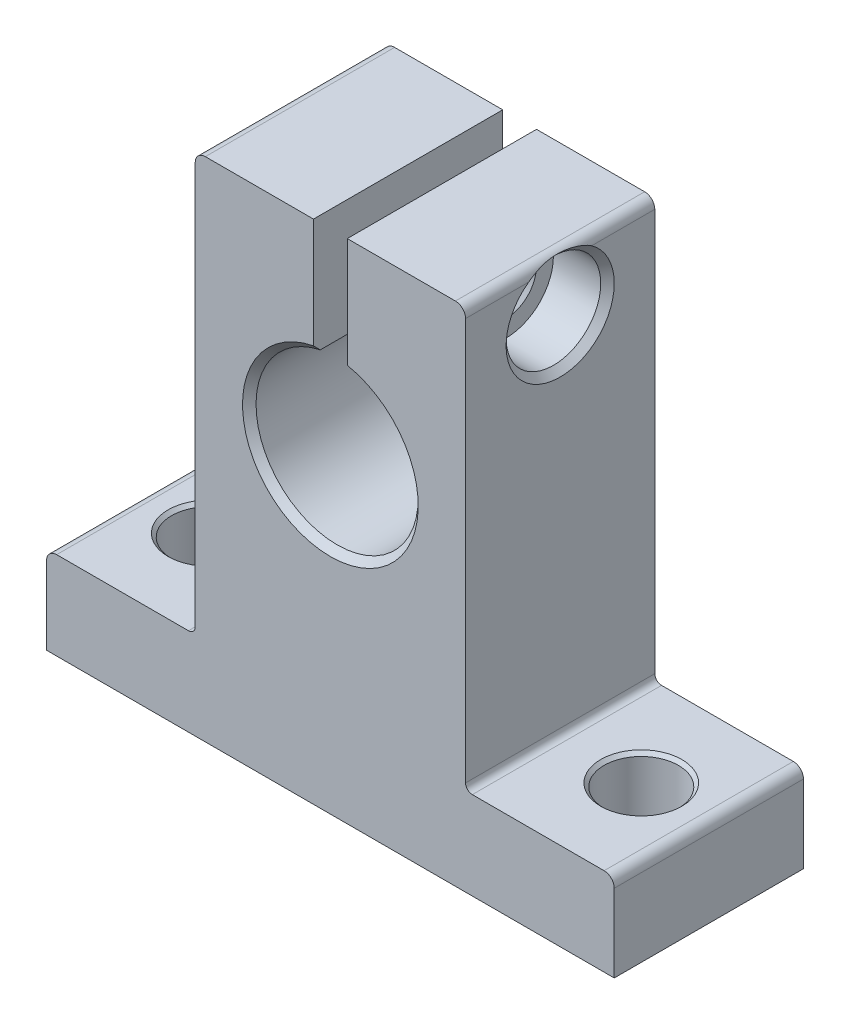
ISO-10303-21;
HEADER;
FILE_DESCRIPTION(('STEP AP214'),'2;1');
FILE_NAME('part.step','',(''),(''),'','','');
FILE_SCHEMA(('AUTOMOTIVE_DESIGN { 1 0 10303 214 1 1 1 1 }'));
ENDSEC;
DATA;
#1=APPLICATION_CONTEXT('core data for automotive mechanical design processes');
#2=APPLICATION_PROTOCOL_DEFINITION('international standard','automotive_design',2000,#1);
#3=PRODUCT_CONTEXT('',#1,'mechanical');
#4=PRODUCT('Part','Part','',(#3));
#5=PRODUCT_RELATED_PRODUCT_CATEGORY('part','',(#4));
#6=PRODUCT_DEFINITION_FORMATION('','',#4);
#7=PRODUCT_DEFINITION_CONTEXT('part definition',#1,'design');
#8=PRODUCT_DEFINITION('design','',#6,#7);
#9=PRODUCT_DEFINITION_SHAPE('','',#8);
#10=(LENGTH_UNIT() NAMED_UNIT(*) SI_UNIT(.MILLI.,.METRE.));
#11=(NAMED_UNIT(*) PLANE_ANGLE_UNIT() SI_UNIT($,.RADIAN.));
#12=(NAMED_UNIT(*) SI_UNIT($,.STERADIAN.) SOLID_ANGLE_UNIT());
#13=UNCERTAINTY_MEASURE_WITH_UNIT(LENGTH_MEASURE(1.E-05),#10,'distance_accuracy_value','');
#14=(GEOMETRIC_REPRESENTATION_CONTEXT(3) GLOBAL_UNCERTAINTY_ASSIGNED_CONTEXT((#13)) GLOBAL_UNIT_ASSIGNED_CONTEXT((#10,
#11,#12)) REPRESENTATION_CONTEXT('',''));
#15=CARTESIAN_POINT('',(0.,0.,0.));
#16=DIRECTION('',(0.,0.,1.));
#17=DIRECTION('',(1.,0.,0.));
#18=AXIS2_PLACEMENT_3D('',#15,#16,#17);
#19=CARTESIAN_POINT('',(-9.99999999999999,14.5,7.));
#20=DIRECTION('',(0.,1.,0.));
#21=DIRECTION('',(0.,0.,1.));
#22=AXIS2_PLACEMENT_3D('',#19,#20,#21);
#23=PLANE('',#22);
#24=DIRECTION('',(1.,0.,0.));
#25=VECTOR('',#24,1.);
#26=CARTESIAN_POINT('',(-9.99999999999999,14.5,-7.));
#27=LINE('',#26,#25);
#28=CARTESIAN_POINT('',(-9.24999999999999,14.5,-7.));
#29=VERTEX_POINT('',#28);
#30=CARTESIAN_POINT('',(-1.25,14.5,-7.));
#31=VERTEX_POINT('',#30);
#32=EDGE_CURVE('E434',#29,#31,#27,.T.);
#33=ORIENTED_EDGE('',*,*,#32,.F.);
#34=DIRECTION('',(0.,0.,-1.));
#35=VECTOR('',#34,1.);
#36=CARTESIAN_POINT('',(-9.24999999999999,14.5,7.));
#37=LINE('',#36,#35);
#38=CARTESIAN_POINT('',(-9.24999999999999,14.5,7.));
#39=VERTEX_POINT('',#38);
#40=EDGE_CURVE('E242',#29,#39,#37,.F.);
#41=ORIENTED_EDGE('',*,*,#40,.T.);
#42=DIRECTION('',(1.,0.,0.));
#43=VECTOR('',#42,1.);
#44=CARTESIAN_POINT('',(-9.99999999999999,14.5,7.));
#45=LINE('',#44,#43);
#46=CARTESIAN_POINT('',(-1.25,14.5,7.));
#47=VERTEX_POINT('',#46);
#48=EDGE_CURVE('E418',#39,#47,#45,.T.);
#49=ORIENTED_EDGE('',*,*,#48,.T.);
#50=DIRECTION('',(0.,0.,-1.));
#51=VECTOR('',#50,1.);
#52=CARTESIAN_POINT('',(-1.25,14.5,7.));
#53=LINE('',#52,#51);
#54=EDGE_CURVE('E423',#47,#31,#53,.T.);
#55=ORIENTED_EDGE('',*,*,#54,.T.);
#56=EDGE_LOOP('',(#33,#41,#49,#55));
#57=FACE_BOUND('',#56,.T.);
#58=ADVANCED_FACE('F38',(#57),#23,.T.);
#59=CARTESIAN_POINT('',(-9.99999999999999,14.5,7.));
#60=DIRECTION('',(1.,0.,0.));
#61=DIRECTION('',(0.,1.,0.));
#62=AXIS2_PLACEMENT_3D('',#59,#60,#61);
#63=PLANE('',#62);
#64=CARTESIAN_POINT('',(-9.99999999999999,10.5,0.));
#65=DIRECTION('',(-1.,0.,0.));
#66=DIRECTION('',(0.,0.,1.));
#67=AXIS2_PLACEMENT_3D('',#64,#65,#66);
#68=CIRCLE('',#67,1.45);
#69=CARTESIAN_POINT('',(-9.99999999999999,10.5,1.45));
#70=VERTEX_POINT('',#69);
#71=EDGE_CURVE('E536',#70,#70,#68,.T.);
#72=ORIENTED_EDGE('',*,*,#71,.F.);
#73=EDGE_LOOP('',(#72));
#74=FACE_BOUND('',#73,.T.);
#75=DIRECTION('',(0.,-1.,0.));
#76=VECTOR('',#75,1.);
#77=CARTESIAN_POINT('',(-9.99999999999999,14.5,-7.));
#78=LINE('',#77,#76);
#79=CARTESIAN_POINT('',(-9.99999999999999,13.75,-7.));
#80=VERTEX_POINT('',#79);
#81=CARTESIAN_POINT('',(-10.,-16.,-7.));
#82=VERTEX_POINT('',#81);
#83=EDGE_CURVE('E463',#80,#82,#78,.T.);
#84=ORIENTED_EDGE('',*,*,#83,.T.);
#85=DIRECTION('',(0.,0.,-1.));
#86=VECTOR('',#85,1.);
#87=CARTESIAN_POINT('',(-10.,-16.,7.));
#88=LINE('',#87,#86);
#89=CARTESIAN_POINT('',(-10.,-16.,7.));
#90=VERTEX_POINT('',#89);
#91=EDGE_CURVE('E208',#82,#90,#88,.F.);
#92=ORIENTED_EDGE('',*,*,#91,.T.);
#93=DIRECTION('',(0.,-1.,0.));
#94=VECTOR('',#93,1.);
#95=CARTESIAN_POINT('',(-9.99999999999999,14.5,7.));
#96=LINE('',#95,#94);
#97=CARTESIAN_POINT('',(-9.99999999999999,13.75,7.));
#98=VERTEX_POINT('',#97);
#99=EDGE_CURVE('E416',#98,#90,#96,.T.);
#100=ORIENTED_EDGE('',*,*,#99,.F.);
#101=DIRECTION('',(0.,0.,-1.));
#102=VECTOR('',#101,1.);
#103=CARTESIAN_POINT('',(-9.99999999999999,13.75,-7.));
#104=LINE('',#103,#102);
#105=EDGE_CURVE('E211',#98,#80,#104,.T.);
#106=ORIENTED_EDGE('',*,*,#105,.T.);
#107=EDGE_LOOP('',(#84,#92,#100,#106));
#108=FACE_BOUND('',#107,.T.);
#109=ADVANCED_FACE('F319',(#74,#108),#63,.F.);
#110=CARTESIAN_POINT('',(-21.,-16.5,7.));
#111=DIRECTION('',(0.,1.,0.));
#112=DIRECTION('',(0.,0.,1.));
#113=AXIS2_PLACEMENT_3D('',#110,#111,#112);
#114=PLANE('',#113);
#115=CARTESIAN_POINT('',(-16.,-16.5,0.));
#116=DIRECTION('',(0.,1.,0.));
#117=DIRECTION('',(0.,0.,1.));
#118=AXIS2_PLACEMENT_3D('',#115,#116,#117);
#119=CIRCLE('',#118,3.);
#120=CARTESIAN_POINT('',(-16.,-16.5,3.));
#121=VERTEX_POINT('',#120);
#122=EDGE_CURVE('E527',#121,#121,#119,.T.);
#123=ORIENTED_EDGE('',*,*,#122,.F.);
#124=EDGE_LOOP('',(#123));
#125=FACE_BOUND('',#124,.T.);
#126=DIRECTION('',(1.,0.,0.));
#127=VECTOR('',#126,1.);
#128=CARTESIAN_POINT('',(-21.,-16.5,7.));
#129=LINE('',#128,#127);
#130=CARTESIAN_POINT('',(-20.25,-16.5,7.));
#131=VERTEX_POINT('',#130);
#132=CARTESIAN_POINT('',(-10.5,-16.5,7.));
#133=VERTEX_POINT('',#132);
#134=EDGE_CURVE('E424',#131,#133,#129,.T.);
#135=ORIENTED_EDGE('',*,*,#134,.T.);
#136=DIRECTION('',(0.,0.,-1.));
#137=VECTOR('',#136,1.);
#138=CARTESIAN_POINT('',(-10.5,-16.5,7.));
#139=LINE('',#138,#137);
#140=CARTESIAN_POINT('',(-10.5,-16.5,-7.));
#141=VERTEX_POINT('',#140);
#142=EDGE_CURVE('E477',#133,#141,#139,.T.);
#143=ORIENTED_EDGE('',*,*,#142,.T.);
#144=DIRECTION('',(1.,0.,0.));
#145=VECTOR('',#144,1.);
#146=CARTESIAN_POINT('',(-21.,-16.5,-7.));
#147=LINE('',#146,#145);
#148=CARTESIAN_POINT('',(-20.25,-16.5,-7.));
#149=VERTEX_POINT('',#148);
#150=EDGE_CURVE('E460',#149,#141,#147,.T.);
#151=ORIENTED_EDGE('',*,*,#150,.F.);
#152=DIRECTION('',(0.,0.,-1.));
#153=VECTOR('',#152,1.);
#154=CARTESIAN_POINT('',(-20.25,-16.5,7.));
#155=LINE('',#154,#153);
#156=EDGE_CURVE('E467',#149,#131,#155,.F.);
#157=ORIENTED_EDGE('',*,*,#156,.T.);
#158=EDGE_LOOP('',(#135,#143,#151,#157));
#159=FACE_BOUND('',#158,.T.);
#160=ADVANCED_FACE('F322',(#125,#159),#114,.T.);
#161=CARTESIAN_POINT('',(-21.,-23.,7.));
#162=DIRECTION('',(-1.,0.,0.));
#163=DIRECTION('',(0.,-1.,0.));
#164=AXIS2_PLACEMENT_3D('',#161,#162,#163);
#165=PLANE('',#164);
#166=DIRECTION('',(0.,1.,0.));
#167=VECTOR('',#166,1.);
#168=CARTESIAN_POINT('',(-21.,-23.,7.));
#169=LINE('',#168,#167);
#170=CARTESIAN_POINT('',(-21.,-23.,7.));
#171=VERTEX_POINT('',#170);
#172=CARTESIAN_POINT('',(-21.,-17.25,7.));
#173=VERTEX_POINT('',#172);
#174=EDGE_CURVE('E430',#171,#173,#169,.T.);
#175=ORIENTED_EDGE('',*,*,#174,.T.);
#176=DIRECTION('',(0.,0.,-1.));
#177=VECTOR('',#176,1.);
#178=CARTESIAN_POINT('',(-21.,-17.25,7.));
#179=LINE('',#178,#177);
#180=CARTESIAN_POINT('',(-21.,-17.25,-7.));
#181=VERTEX_POINT('',#180);
#182=EDGE_CURVE('E222',#173,#181,#179,.T.);
#183=ORIENTED_EDGE('',*,*,#182,.T.);
#184=DIRECTION('',(0.,1.,0.));
#185=VECTOR('',#184,1.);
#186=CARTESIAN_POINT('',(-21.,-23.,-7.));
#187=LINE('',#186,#185);
#188=CARTESIAN_POINT('',(-21.,-23.,-7.));
#189=VERTEX_POINT('',#188);
#190=EDGE_CURVE('E457',#189,#181,#187,.T.);
#191=ORIENTED_EDGE('',*,*,#190,.F.);
#192=DIRECTION('',(0.,0.,-1.));
#193=VECTOR('',#192,1.);
#194=CARTESIAN_POINT('',(-21.,-23.,7.));
#195=LINE('',#194,#193);
#196=EDGE_CURVE('E465',#171,#189,#195,.T.);
#197=ORIENTED_EDGE('',*,*,#196,.F.);
#198=EDGE_LOOP('',(#175,#183,#191,#197));
#199=FACE_BOUND('',#198,.T.);
#200=ADVANCED_FACE('F326',(#199),#165,.T.);
#201=CARTESIAN_POINT('',(-21.,-23.,7.));
#202=DIRECTION('',(0.,1.,0.));
#203=DIRECTION('',(-1.,0.,0.));
#204=AXIS2_PLACEMENT_3D('',#201,#202,#203);
#205=PLANE('',#204);
#206=CARTESIAN_POINT('',(-16.,-23.,0.));
#207=DIRECTION('',(0.,1.,0.));
#208=DIRECTION('',(0.,0.,1.));
#209=AXIS2_PLACEMENT_3D('',#206,#207,#208);
#210=CIRCLE('',#209,3.);
#211=CARTESIAN_POINT('',(-16.,-23.,3.));
#212=VERTEX_POINT('',#211);
#213=EDGE_CURVE('E530',#212,#212,#210,.T.);
#214=ORIENTED_EDGE('',*,*,#213,.T.);
#215=EDGE_LOOP('',(#214));
#216=FACE_BOUND('',#215,.T.);
#217=CARTESIAN_POINT('',(16.,-23.,0.));
#218=DIRECTION('',(0.,1.,0.));
#219=DIRECTION('',(0.,0.,1.));
#220=AXIS2_PLACEMENT_3D('',#217,#218,#219);
#221=CIRCLE('',#220,3.);
#222=CARTESIAN_POINT('',(16.,-23.,3.));
#223=VERTEX_POINT('',#222);
#224=EDGE_CURVE('E518',#223,#223,#221,.T.);
#225=ORIENTED_EDGE('',*,*,#224,.T.);
#226=EDGE_LOOP('',(#225));
#227=FACE_BOUND('',#226,.T.);
#228=DIRECTION('',(1.,0.,0.));
#229=VECTOR('',#228,1.);
#230=CARTESIAN_POINT('',(-21.,-23.,-7.));
#231=LINE('',#230,#229);
#232=CARTESIAN_POINT('',(21.,-23.,-7.));
#233=VERTEX_POINT('',#232);
#234=EDGE_CURVE('E455',#189,#233,#231,.T.);
#235=ORIENTED_EDGE('',*,*,#234,.T.);
#236=DIRECTION('',(0.,0.,-1.));
#237=VECTOR('',#236,1.);
#238=CARTESIAN_POINT('',(21.,-23.,7.));
#239=LINE('',#238,#237);
#240=CARTESIAN_POINT('',(21.,-23.,7.));
#241=VERTEX_POINT('',#240);
#242=EDGE_CURVE('E468',#241,#233,#239,.T.);
#243=ORIENTED_EDGE('',*,*,#242,.F.);
#244=DIRECTION('',(1.,0.,0.));
#245=VECTOR('',#244,1.);
#246=CARTESIAN_POINT('',(-21.,-23.,7.));
#247=LINE('',#246,#245);
#248=EDGE_CURVE('E491',#171,#241,#247,.T.);
#249=ORIENTED_EDGE('',*,*,#248,.F.);
#250=ORIENTED_EDGE('',*,*,#196,.T.);
#251=EDGE_LOOP('',(#235,#243,#249,#250));
#252=FACE_BOUND('',#251,.T.);
#253=ADVANCED_FACE('F330',(#216,#227,#252),#205,.F.);
#254=CARTESIAN_POINT('',(21.,-23.,7.));
#255=DIRECTION('',(-1.,0.,0.));
#256=DIRECTION('',(0.,-1.,0.));
#257=AXIS2_PLACEMENT_3D('',#254,#255,#256);
#258=PLANE('',#257);
#259=DIRECTION('',(0.,1.,0.));
#260=VECTOR('',#259,1.);
#261=CARTESIAN_POINT('',(21.,-23.,-7.));
#262=LINE('',#261,#260);
#263=CARTESIAN_POINT('',(21.,-17.25,-7.));
#264=VERTEX_POINT('',#263);
#265=EDGE_CURVE('E452',#233,#264,#262,.T.);
#266=ORIENTED_EDGE('',*,*,#265,.T.);
#267=DIRECTION('',(0.,0.,-1.));
#268=VECTOR('',#267,1.);
#269=CARTESIAN_POINT('',(21.,-17.25,7.));
#270=LINE('',#269,#268);
#271=CARTESIAN_POINT('',(21.,-17.25,7.));
#272=VERTEX_POINT('',#271);
#273=EDGE_CURVE('E240',#264,#272,#270,.F.);
#274=ORIENTED_EDGE('',*,*,#273,.T.);
#275=DIRECTION('',(0.,1.,0.));
#276=VECTOR('',#275,1.);
#277=CARTESIAN_POINT('',(21.,-23.,7.));
#278=LINE('',#277,#276);
#279=EDGE_CURVE('E492',#241,#272,#278,.T.);
#280=ORIENTED_EDGE('',*,*,#279,.F.);
#281=ORIENTED_EDGE('',*,*,#242,.T.);
#282=EDGE_LOOP('',(#266,#274,#280,#281));
#283=FACE_BOUND('',#282,.T.);
#284=ADVANCED_FACE('F334',(#283),#258,.F.);
#285=CARTESIAN_POINT('',(10.,-16.5,7.));
#286=DIRECTION('',(0.,1.,0.));
#287=DIRECTION('',(0.,0.,1.));
#288=AXIS2_PLACEMENT_3D('',#285,#286,#287);
#289=PLANE('',#288);
#290=CARTESIAN_POINT('',(16.,-16.5,0.));
#291=DIRECTION('',(0.,1.,0.));
#292=DIRECTION('',(0.,0.,1.));
#293=AXIS2_PLACEMENT_3D('',#290,#291,#292);
#294=CIRCLE('',#293,3.);
#295=CARTESIAN_POINT('',(16.,-16.5,3.));
#296=VERTEX_POINT('',#295);
#297=EDGE_CURVE('E515',#296,#296,#294,.T.);
#298=ORIENTED_EDGE('',*,*,#297,.F.);
#299=EDGE_LOOP('',(#298));
#300=FACE_BOUND('',#299,.T.);
#301=DIRECTION('',(1.,0.,0.));
#302=VECTOR('',#301,1.);
#303=CARTESIAN_POINT('',(10.,-16.5,-7.));
#304=LINE('',#303,#302);
#305=CARTESIAN_POINT('',(10.5,-16.5,-7.));
#306=VERTEX_POINT('',#305);
#307=CARTESIAN_POINT('',(20.25,-16.5,-7.));
#308=VERTEX_POINT('',#307);
#309=EDGE_CURVE('E449',#306,#308,#304,.T.);
#310=ORIENTED_EDGE('',*,*,#309,.F.);
#311=DIRECTION('',(0.,0.,-1.));
#312=VECTOR('',#311,1.);
#313=CARTESIAN_POINT('',(10.5,-16.5,7.));
#314=LINE('',#313,#312);
#315=CARTESIAN_POINT('',(10.5,-16.5,7.));
#316=VERTEX_POINT('',#315);
#317=EDGE_CURVE('E220',#306,#316,#314,.F.);
#318=ORIENTED_EDGE('',*,*,#317,.T.);
#319=DIRECTION('',(1.,0.,0.));
#320=VECTOR('',#319,1.);
#321=CARTESIAN_POINT('',(10.,-16.5,7.));
#322=LINE('',#321,#320);
#323=CARTESIAN_POINT('',(20.25,-16.5,7.));
#324=VERTEX_POINT('',#323);
#325=EDGE_CURVE('E497',#316,#324,#322,.T.);
#326=ORIENTED_EDGE('',*,*,#325,.T.);
#327=DIRECTION('',(0.,0.,-1.));
#328=VECTOR('',#327,1.);
#329=CARTESIAN_POINT('',(20.25,-16.5,-7.));
#330=LINE('',#329,#328);
#331=EDGE_CURVE('E217',#324,#308,#330,.T.);
#332=ORIENTED_EDGE('',*,*,#331,.T.);
#333=EDGE_LOOP('',(#310,#318,#326,#332));
#334=FACE_BOUND('',#333,.T.);
#335=ADVANCED_FACE('F338',(#300,#334),#289,.T.);
#336=CARTESIAN_POINT('',(9.99999999999999,14.5,7.));
#337=DIRECTION('',(1.,0.,0.));
#338=DIRECTION('',(0.,1.,0.));
#339=AXIS2_PLACEMENT_3D('',#336,#337,#338);
#340=PLANE('',#339);
#341=CARTESIAN_POINT('',(10.,10.5,0.));
#342=DIRECTION('',(1.,0.,0.));
#343=DIRECTION('',(0.,0.,-1.));
#344=AXIS2_PLACEMENT_3D('',#341,#342,#343);
#345=CIRCLE('',#344,4.);
#346=CARTESIAN_POINT('',(10.,13.75,2.33184476327221));
#347=VERTEX_POINT('',#346);
#348=CARTESIAN_POINT('',(9.99999999999999,13.75,-2.3318447632722));
#349=VERTEX_POINT('',#348);
#350=EDGE_CURVE('E187',#347,#349,#345,.T.);
#351=ORIENTED_EDGE('',*,*,#350,.F.);
#352=DIRECTION('',(0.,0.,-1.));
#353=VECTOR('',#352,1.);
#354=CARTESIAN_POINT('',(9.99999999999999,13.75,7.));
#355=LINE('',#354,#353);
#356=CARTESIAN_POINT('',(9.99999999999999,13.75,7.));
#357=VERTEX_POINT('',#356);
#358=EDGE_CURVE('E198',#347,#357,#355,.F.);
#359=ORIENTED_EDGE('',*,*,#358,.T.);
#360=DIRECTION('',(0.,-1.,0.));
#361=VECTOR('',#360,1.);
#362=CARTESIAN_POINT('',(9.99999999999999,14.5,7.));
#363=LINE('',#362,#361);
#364=CARTESIAN_POINT('',(10.,-16.,7.));
#365=VERTEX_POINT('',#364);
#366=EDGE_CURVE('E500',#357,#365,#363,.T.);
#367=ORIENTED_EDGE('',*,*,#366,.T.);
#368=DIRECTION('',(0.,0.,-1.));
#369=VECTOR('',#368,1.);
#370=CARTESIAN_POINT('',(10.,-16.,-7.));
#371=LINE('',#370,#369);
#372=CARTESIAN_POINT('',(10.,-16.,-7.));
#373=VERTEX_POINT('',#372);
#374=EDGE_CURVE('E210',#365,#373,#371,.T.);
#375=ORIENTED_EDGE('',*,*,#374,.T.);
#376=DIRECTION('',(0.,-1.,0.));
#377=VECTOR('',#376,1.);
#378=CARTESIAN_POINT('',(9.99999999999999,14.5,-7.));
#379=LINE('',#378,#377);
#380=CARTESIAN_POINT('',(9.99999999999999,13.75,-7.));
#381=VERTEX_POINT('',#380);
#382=EDGE_CURVE('E446',#381,#373,#379,.T.);
#383=ORIENTED_EDGE('',*,*,#382,.F.);
#384=EDGE_CURVE('E201',#381,#349,#355,.F.);
#385=ORIENTED_EDGE('',*,*,#384,.T.);
#386=EDGE_LOOP('',(#351,#359,#367,#375,#383,#385));
#387=FACE_BOUND('',#386,.T.);
#388=ADVANCED_FACE('F196',(#387),#340,.T.);
#389=CARTESIAN_POINT('',(1.25,14.5,7.));
#390=DIRECTION('',(0.,1.,0.));
#391=DIRECTION('',(-1.,0.,0.));
#392=AXIS2_PLACEMENT_3D('',#389,#390,#391);
#393=PLANE('',#392);
#394=DIRECTION('',(1.,0.,0.));
#395=VECTOR('',#394,1.);
#396=CARTESIAN_POINT('',(1.25,14.5,7.));
#397=LINE('',#396,#395);
#398=CARTESIAN_POINT('',(1.25,14.5,7.));
#399=VERTEX_POINT('',#398);
#400=CARTESIAN_POINT('',(9.24999999999999,14.5,7.));
#401=VERTEX_POINT('',#400);
#402=EDGE_CURVE('E502',#399,#401,#397,.T.);
#403=ORIENTED_EDGE('',*,*,#402,.T.);
#404=DIRECTION('',(0.,0.,-1.));
#405=VECTOR('',#404,1.);
#406=CARTESIAN_POINT('',(9.24999999999999,14.5,7.));
#407=LINE('',#406,#405);
#408=CARTESIAN_POINT('',(9.24999999999999,14.5,-7.));
#409=VERTEX_POINT('',#408);
#410=EDGE_CURVE('E244',#401,#409,#407,.T.);
#411=ORIENTED_EDGE('',*,*,#410,.T.);
#412=DIRECTION('',(1.,0.,0.));
#413=VECTOR('',#412,1.);
#414=CARTESIAN_POINT('',(1.25,14.5,-7.));
#415=LINE('',#414,#413);
#416=CARTESIAN_POINT('',(1.25,14.5,-7.));
#417=VERTEX_POINT('',#416);
#418=EDGE_CURVE('E443',#417,#409,#415,.T.);
#419=ORIENTED_EDGE('',*,*,#418,.F.);
#420=DIRECTION('',(0.,0.,-1.));
#421=VECTOR('',#420,1.);
#422=CARTESIAN_POINT('',(1.25,14.5,7.));
#423=LINE('',#422,#421);
#424=EDGE_CURVE('E471',#399,#417,#423,.T.);
#425=ORIENTED_EDGE('',*,*,#424,.F.);
#426=EDGE_LOOP('',(#403,#411,#419,#425));
#427=FACE_BOUND('',#426,.T.);
#428=ADVANCED_FACE('F345',(#427),#393,.T.);
#429=CARTESIAN_POINT('',(1.25,14.5,7.));
#430=DIRECTION('',(1.,0.,0.));
#431=DIRECTION('',(0.,1.,0.));
#432=AXIS2_PLACEMENT_3D('',#429,#430,#431);
#433=PLANE('',#432);
#434=CARTESIAN_POINT('',(1.25,10.5,0.));
#435=DIRECTION('',(1.,0.,0.));
#436=DIRECTION('',(0.,1.,0.));
#437=AXIS2_PLACEMENT_3D('',#434,#435,#436);
#438=CIRCLE('',#437,2.);
#439=CARTESIAN_POINT('',(1.25,12.5,0.));
#440=VERTEX_POINT('',#439);
#441=EDGE_CURVE('E539',#440,#440,#438,.T.);
#442=ORIENTED_EDGE('',*,*,#441,.T.);
#443=EDGE_LOOP('',(#442));
#444=FACE_BOUND('',#443,.T.);
#445=DIRECTION('',(0.,-1.,0.));
#446=VECTOR('',#445,1.);
#447=CARTESIAN_POINT('',(1.25,14.5,-7.));
#448=LINE('',#447,#446);
#449=CARTESIAN_POINT('',(1.25,6.37867541108654,-7.));
#450=VERTEX_POINT('',#449);
#451=EDGE_CURVE('E440',#417,#450,#448,.T.);
#452=ORIENTED_EDGE('',*,*,#451,.T.);
#453=CARTESIAN_POINT('',(1.25,6.37867541108654,-7.));
#454=CARTESIAN_POINT('',(1.25,6.29369027673478,-6.91659567988044));
#455=CARTESIAN_POINT('',(1.25,6.20867036702757,-6.83322685344399));
#456=CARTESIAN_POINT('',(1.25,6.03856099571727,-6.66656018677634));
#457=CARTESIAN_POINT('',(1.25,5.95347153411322,-6.58326234654612));
#458=CARTESIAN_POINT('',(1.25,5.86834729715275,-6.5));
#459=B_SPLINE_CURVE_WITH_KNOTS('',3,(#453,#454,#455,#456,#457,#458),.UNSPECIFIED.,.F.,.F.,(4,2,
4),(0.,0.357223622416151,0.714447249809102),.UNSPECIFIED.);
#460=CARTESIAN_POINT('',(1.25,5.86834729715275,-6.5));
#461=VERTEX_POINT('',#460);
#462=EDGE_CURVE('E362',#450,#461,#459,.T.);
#463=ORIENTED_EDGE('',*,*,#462,.T.);
#464=DIRECTION('',(0.,0.,-1.));
#465=VECTOR('',#464,1.);
#466=CARTESIAN_POINT('',(1.25,5.86834729715275,7.));
#467=LINE('',#466,#465);
#468=CARTESIAN_POINT('',(1.25,5.86834729715275,6.5));
#469=VERTEX_POINT('',#468);
#470=EDGE_CURVE('E473',#469,#461,#467,.T.);
#471=ORIENTED_EDGE('',*,*,#470,.F.);
#472=CARTESIAN_POINT('',(1.25,5.86834729715275,6.5));
#473=CARTESIAN_POINT('',(1.25,5.95347153411322,6.58326234654612));
#474=CARTESIAN_POINT('',(1.25,6.03856099571727,6.66656018677634));
#475=CARTESIAN_POINT('',(1.25,6.20867036702756,6.83322685344399));
#476=CARTESIAN_POINT('',(1.25,6.29369027673477,6.91659567988044));
#477=CARTESIAN_POINT('',(1.25,6.37867541108653,7.));
#478=B_SPLINE_CURVE_WITH_KNOTS('',3,(#472,#473,#474,#475,#476,#477),.UNSPECIFIED.,.F.,.F.,(4,2,
4),(0.,0.357223627392948,0.714447249809097),.UNSPECIFIED.);
#479=CARTESIAN_POINT('',(1.25,6.37867541108654,7.));
#480=VERTEX_POINT('',#479);
#481=EDGE_CURVE('E357',#469,#480,#478,.T.);
#482=ORIENTED_EDGE('',*,*,#481,.T.);
#483=DIRECTION('',(0.,-1.,0.));
#484=VECTOR('',#483,1.);
#485=CARTESIAN_POINT('',(1.25,14.5,7.));
#486=LINE('',#485,#484);
#487=EDGE_CURVE('E505',#399,#480,#486,.T.);
#488=ORIENTED_EDGE('',*,*,#487,.F.);
#489=ORIENTED_EDGE('',*,*,#424,.T.);
#490=EDGE_LOOP('',(#452,#463,#471,#482,#488,#489));
#491=FACE_BOUND('',#490,.T.);
#492=ADVANCED_FACE('F348',(#444,#491),#433,.F.);
#493=CARTESIAN_POINT('',(0.,0.,7.));
#494=DIRECTION('',(0.,0.,-1.));
#495=DIRECTION('',(-1.,0.,0.));
#496=AXIS2_PLACEMENT_3D('',#493,#494,#495);
#497=CYLINDRICAL_SURFACE('',#496,6.);
#498=ORIENTED_EDGE('',*,*,#470,.T.);
#499=CARTESIAN_POINT('',(0.,0.,-6.5));
#500=DIRECTION('',(0.,0.,1.));
#501=DIRECTION('',(1.,0.,0.));
#502=AXIS2_PLACEMENT_3D('',#499,#500,#501);
#503=CIRCLE('',#502,6.);
#504=CARTESIAN_POINT('',(-1.25,5.86834729715275,-6.5));
#505=VERTEX_POINT('',#504);
#506=EDGE_CURVE('E60',#461,#505,#503,.F.);
#507=ORIENTED_EDGE('',*,*,#506,.T.);
#508=DIRECTION('',(0.,0.,-1.));
#509=VECTOR('',#508,1.);
#510=CARTESIAN_POINT('',(-1.25,5.86834729715275,7.));
#511=LINE('',#510,#509);
#512=CARTESIAN_POINT('',(-1.25,5.86834729715275,6.5));
#513=VERTEX_POINT('',#512);
#514=EDGE_CURVE('E427',#513,#505,#511,.T.);
#515=ORIENTED_EDGE('',*,*,#514,.F.);
#516=CARTESIAN_POINT('',(0.,0.,6.5));
#517=DIRECTION('',(0.,0.,1.));
#518=DIRECTION('',(1.,0.,0.));
#519=AXIS2_PLACEMENT_3D('',#516,#517,#518);
#520=CIRCLE('',#519,6.);
#521=EDGE_CURVE('E367',#513,#469,#520,.T.);
#522=ORIENTED_EDGE('',*,*,#521,.T.);
#523=EDGE_LOOP('',(#498,#507,#515,#522));
#524=FACE_BOUND('',#523,.T.);
#525=ADVANCED_FACE('F353',(#524),#497,.F.);
#526=CARTESIAN_POINT('',(-1.25,14.5,7.));
#527=DIRECTION('',(1.,0.,0.));
#528=DIRECTION('',(0.,1.,0.));
#529=AXIS2_PLACEMENT_3D('',#526,#527,#528);
#530=PLANE('',#529);
#531=CARTESIAN_POINT('',(-1.25,10.5,0.));
#532=DIRECTION('',(1.,0.,0.));
#533=DIRECTION('',(0.,1.,0.));
#534=AXIS2_PLACEMENT_3D('',#531,#532,#533);
#535=CIRCLE('',#534,1.45);
#536=CARTESIAN_POINT('',(-1.25,11.95,0.));
#537=VERTEX_POINT('',#536);
#538=EDGE_CURVE('E533',#537,#537,#535,.T.);
#539=ORIENTED_EDGE('',*,*,#538,.F.);
#540=EDGE_LOOP('',(#539));
#541=FACE_BOUND('',#540,.T.);
#542=ORIENTED_EDGE('',*,*,#514,.T.);
#543=CARTESIAN_POINT('',(-1.25,5.86834729715275,-6.5));
#544=CARTESIAN_POINT('',(-1.25,5.95347153411322,-6.58326234654612));
#545=CARTESIAN_POINT('',(-1.25,6.03856099571727,-6.66656018677634));
#546=CARTESIAN_POINT('',(-1.25,6.20867036702757,-6.83322685344399));
#547=CARTESIAN_POINT('',(-1.25,6.29369027673478,-6.91659567988044));
#548=CARTESIAN_POINT('',(-1.25,6.37867541108654,-7.));
#549=B_SPLINE_CURVE_WITH_KNOTS('',3,(#543,#544,#545,#546,#547,#548),.UNSPECIFIED.,.F.,.F.,(4,2,
4),(0.,0.357223627392951,0.714447249809102),.UNSPECIFIED.);
#550=CARTESIAN_POINT('',(-1.25,6.37867541108654,-7.));
#551=VERTEX_POINT('',#550);
#552=EDGE_CURVE('E47',#505,#551,#549,.T.);
#553=ORIENTED_EDGE('',*,*,#552,.T.);
#554=DIRECTION('',(0.,-1.,0.));
#555=VECTOR('',#554,1.);
#556=CARTESIAN_POINT('',(-1.25,14.5,-7.));
#557=LINE('',#556,#555);
#558=EDGE_CURVE('E436',#31,#551,#557,.T.);
#559=ORIENTED_EDGE('',*,*,#558,.F.);
#560=ORIENTED_EDGE('',*,*,#54,.F.);
#561=DIRECTION('',(0.,-1.,0.));
#562=VECTOR('',#561,1.);
#563=CARTESIAN_POINT('',(-1.25,14.5,7.));
#564=LINE('',#563,#562);
#565=CARTESIAN_POINT('',(-1.25,6.37867541108654,7.));
#566=VERTEX_POINT('',#565);
#567=EDGE_CURVE('E507',#47,#566,#564,.T.);
#568=ORIENTED_EDGE('',*,*,#567,.T.);
#569=CARTESIAN_POINT('',(-1.25,6.37867541108654,7.));
#570=CARTESIAN_POINT('',(-1.25,6.29369027673477,6.91659567988044));
#571=CARTESIAN_POINT('',(-1.25,6.20867036702756,6.83322685344399));
#572=CARTESIAN_POINT('',(-1.25,6.03856099571727,6.66656018677634));
#573=CARTESIAN_POINT('',(-1.25,5.95347153411322,6.58326234654612));
#574=CARTESIAN_POINT('',(-1.25,5.86834729715275,6.5));
#575=B_SPLINE_CURVE_WITH_KNOTS('',3,(#569,#570,#571,#572,#573,#574),.UNSPECIFIED.,.F.,.F.,(4,2,
4),(0.,0.357223622416148,0.714447249809096),.UNSPECIFIED.);
#576=EDGE_CURVE('E377',#566,#513,#575,.T.);
#577=ORIENTED_EDGE('',*,*,#576,.T.);
#578=EDGE_LOOP('',(#542,#553,#559,#560,#568,#577));
#579=FACE_BOUND('',#578,.T.);
#580=ADVANCED_FACE('F315',(#541,#579),#530,.T.);
#581=CARTESIAN_POINT('',(0.,0.,7.));
#582=DIRECTION('',(0.,0.,1.));
#583=DIRECTION('',(1.,0.,0.));
#584=AXIS2_PLACEMENT_3D('',#581,#582,#583);
#585=PLANE('',#584);
#586=ORIENTED_EDGE('',*,*,#487,.T.);
#587=CARTESIAN_POINT('',(0.,0.,7.));
#588=DIRECTION('',(0.,0.,1.));
#589=DIRECTION('',(1.,0.,0.));
#590=AXIS2_PLACEMENT_3D('',#587,#588,#589);
#591=CIRCLE('',#590,6.5);
#592=EDGE_CURVE('E12',#480,#566,#591,.F.);
#593=ORIENTED_EDGE('',*,*,#592,.T.);
#594=ORIENTED_EDGE('',*,*,#567,.F.);
#595=ORIENTED_EDGE('',*,*,#48,.F.);
#596=CARTESIAN_POINT('',(-9.24999999999999,13.75,7.));
#597=DIRECTION('',(0.,0.,1.));
#598=DIRECTION('',(1.,0.,0.));
#599=AXIS2_PLACEMENT_3D('',#596,#597,#598);
#600=CIRCLE('',#599,0.75);
#601=EDGE_CURVE('E234',#39,#98,#600,.T.);
#602=ORIENTED_EDGE('',*,*,#601,.T.);
#603=ORIENTED_EDGE('',*,*,#99,.T.);
#604=CARTESIAN_POINT('',(-10.5,-16.,7.));
#605=DIRECTION('',(0.,0.,1.));
#606=DIRECTION('',(1.,0.,0.));
#607=AXIS2_PLACEMENT_3D('',#604,#605,#606);
#608=CIRCLE('',#607,0.5);
#609=EDGE_CURVE('E249',#90,#133,#608,.F.);
#610=ORIENTED_EDGE('',*,*,#609,.T.);
#611=ORIENTED_EDGE('',*,*,#134,.F.);
#612=CARTESIAN_POINT('',(-20.25,-17.25,7.));
#613=DIRECTION('',(0.,0.,1.));
#614=DIRECTION('',(1.,0.,0.));
#615=AXIS2_PLACEMENT_3D('',#612,#613,#614);
#616=CIRCLE('',#615,0.75);
#617=EDGE_CURVE('E238',#131,#173,#616,.T.);
#618=ORIENTED_EDGE('',*,*,#617,.T.);
#619=ORIENTED_EDGE('',*,*,#174,.F.);
#620=ORIENTED_EDGE('',*,*,#248,.T.);
#621=ORIENTED_EDGE('',*,*,#279,.T.);
#622=CARTESIAN_POINT('',(20.25,-17.25,7.));
#623=DIRECTION('',(0.,0.,1.));
#624=DIRECTION('',(1.,0.,0.));
#625=AXIS2_PLACEMENT_3D('',#622,#623,#624);
#626=CIRCLE('',#625,0.75);
#627=EDGE_CURVE('E236',#272,#324,#626,.T.);
#628=ORIENTED_EDGE('',*,*,#627,.T.);
#629=ORIENTED_EDGE('',*,*,#325,.F.);
#630=CARTESIAN_POINT('',(10.5,-16.,7.));
#631=DIRECTION('',(0.,0.,1.));
#632=DIRECTION('',(1.,0.,0.));
#633=AXIS2_PLACEMENT_3D('',#630,#631,#632);
#634=CIRCLE('',#633,0.5);
#635=EDGE_CURVE('E193',#316,#365,#634,.F.);
#636=ORIENTED_EDGE('',*,*,#635,.T.);
#637=ORIENTED_EDGE('',*,*,#366,.F.);
#638=CARTESIAN_POINT('',(9.24999999999999,13.75,7.));
#639=DIRECTION('',(0.,0.,1.));
#640=DIRECTION('',(1.,0.,0.));
#641=AXIS2_PLACEMENT_3D('',#638,#639,#640);
#642=CIRCLE('',#641,0.75);
#643=EDGE_CURVE('E207',#357,#401,#642,.T.);
#644=ORIENTED_EDGE('',*,*,#643,.T.);
#645=ORIENTED_EDGE('',*,*,#402,.F.);
#646=EDGE_LOOP('',(#586,#593,#594,#595,#602,#603,#610,#611,#618,#619,#620,#621,#628,#629,#636,
#637,#644,#645));
#647=FACE_BOUND('',#646,.T.);
#648=ADVANCED_FACE('F312',(#647),#585,.T.);
#649=CARTESIAN_POINT('',(0.,0.,-7.));
#650=DIRECTION('',(0.,0.,1.));
#651=DIRECTION('',(1.,0.,0.));
#652=AXIS2_PLACEMENT_3D('',#649,#650,#651);
#653=PLANE('',#652);
#654=ORIENTED_EDGE('',*,*,#558,.T.);
#655=CARTESIAN_POINT('',(0.,0.,-7.));
#656=DIRECTION('',(0.,0.,1.));
#657=DIRECTION('',(1.,0.,0.));
#658=AXIS2_PLACEMENT_3D('',#655,#656,#657);
#659=CIRCLE('',#658,6.50000000000001);
#660=EDGE_CURVE('E192',#551,#450,#659,.T.);
#661=ORIENTED_EDGE('',*,*,#660,.T.);
#662=ORIENTED_EDGE('',*,*,#451,.F.);
#663=ORIENTED_EDGE('',*,*,#418,.T.);
#664=CARTESIAN_POINT('',(9.24999999999999,13.75,-7.));
#665=DIRECTION('',(0.,0.,1.));
#666=DIRECTION('',(1.,0.,0.));
#667=AXIS2_PLACEMENT_3D('',#664,#665,#666);
#668=CIRCLE('',#667,0.75);
#669=EDGE_CURVE('E225',#409,#381,#668,.F.);
#670=ORIENTED_EDGE('',*,*,#669,.T.);
#671=ORIENTED_EDGE('',*,*,#382,.T.);
#672=CARTESIAN_POINT('',(10.5,-16.,-7.));
#673=DIRECTION('',(0.,0.,1.));
#674=DIRECTION('',(1.,0.,0.));
#675=AXIS2_PLACEMENT_3D('',#672,#673,#674);
#676=CIRCLE('',#675,0.5);
#677=EDGE_CURVE('E251',#373,#306,#676,.T.);
#678=ORIENTED_EDGE('',*,*,#677,.T.);
#679=ORIENTED_EDGE('',*,*,#309,.T.);
#680=CARTESIAN_POINT('',(20.25,-17.25,-7.));
#681=DIRECTION('',(0.,0.,1.));
#682=DIRECTION('',(1.,0.,0.));
#683=AXIS2_PLACEMENT_3D('',#680,#681,#682);
#684=CIRCLE('',#683,0.75);
#685=EDGE_CURVE('E229',#308,#264,#684,.F.);
#686=ORIENTED_EDGE('',*,*,#685,.T.);
#687=ORIENTED_EDGE('',*,*,#265,.F.);
#688=ORIENTED_EDGE('',*,*,#234,.F.);
#689=ORIENTED_EDGE('',*,*,#190,.T.);
#690=CARTESIAN_POINT('',(-20.25,-17.25,-7.));
#691=DIRECTION('',(0.,0.,1.));
#692=DIRECTION('',(1.,0.,0.));
#693=AXIS2_PLACEMENT_3D('',#690,#691,#692);
#694=CIRCLE('',#693,0.75);
#695=EDGE_CURVE('E231',#181,#149,#694,.F.);
#696=ORIENTED_EDGE('',*,*,#695,.T.);
#697=ORIENTED_EDGE('',*,*,#150,.T.);
#698=CARTESIAN_POINT('',(-10.5,-16.,-7.));
#699=DIRECTION('',(0.,0.,1.));
#700=DIRECTION('',(1.,0.,0.));
#701=AXIS2_PLACEMENT_3D('',#698,#699,#700);
#702=CIRCLE('',#701,0.5);
#703=EDGE_CURVE('E247',#141,#82,#702,.T.);
#704=ORIENTED_EDGE('',*,*,#703,.T.);
#705=ORIENTED_EDGE('',*,*,#83,.F.);
#706=CARTESIAN_POINT('',(-9.24999999999999,13.75,-7.));
#707=DIRECTION('',(0.,0.,1.));
#708=DIRECTION('',(1.,0.,0.));
#709=AXIS2_PLACEMENT_3D('',#706,#707,#708);
#710=CIRCLE('',#709,0.75);
#711=EDGE_CURVE('E227',#80,#29,#710,.F.);
#712=ORIENTED_EDGE('',*,*,#711,.T.);
#713=ORIENTED_EDGE('',*,*,#32,.T.);
#714=EDGE_LOOP('',(#654,#661,#662,#663,#670,#671,#678,#679,#686,#687,#688,#689,#696,#697,#704,
#705,#712,#713));
#715=FACE_BOUND('',#714,.T.);
#716=ADVANCED_FACE('F310',(#715),#653,.F.);
#717=CARTESIAN_POINT('',(16.,-22.75,0.));
#718=DIRECTION('',(0.,-1.,0.));
#719=DIRECTION('',(0.,0.,-1.));
#720=AXIS2_PLACEMENT_3D('',#717,#718,#719);
#721=CONICAL_SURFACE('',#720,2.75,0.785398163397442);
#722=ORIENTED_EDGE('',*,*,#224,.F.);
#723=EDGE_LOOP('',(#722));
#724=FACE_BOUND('',#723,.T.);
#725=CARTESIAN_POINT('',(16.,-22.75,0.));
#726=DIRECTION('',(0.,1.,0.));
#727=DIRECTION('',(0.,0.,1.));
#728=AXIS2_PLACEMENT_3D('',#725,#726,#727);
#729=CIRCLE('',#728,2.75);
#730=CARTESIAN_POINT('',(16.,-22.75,2.75));
#731=VERTEX_POINT('',#730);
#732=EDGE_CURVE('E437',#731,#731,#729,.T.);
#733=ORIENTED_EDGE('',*,*,#732,.T.);
#734=EDGE_LOOP('',(#733));
#735=FACE_BOUND('',#734,.T.);
#736=ADVANCED_FACE('F306',(#724,#735),#721,.F.);
#737=CARTESIAN_POINT('',(16.,-16.5,0.));
#738=DIRECTION('',(0.,1.,0.));
#739=DIRECTION('',(0.,0.,1.));
#740=AXIS2_PLACEMENT_3D('',#737,#738,#739);
#741=CYLINDRICAL_SURFACE('',#740,2.75);
#742=ORIENTED_EDGE('',*,*,#732,.F.);
#743=EDGE_LOOP('',(#742));
#744=FACE_BOUND('',#743,.T.);
#745=CARTESIAN_POINT('',(16.,-16.75,0.));
#746=DIRECTION('',(0.,1.,0.));
#747=DIRECTION('',(0.,0.,1.));
#748=AXIS2_PLACEMENT_3D('',#745,#746,#747);
#749=CIRCLE('',#748,2.75);
#750=CARTESIAN_POINT('',(16.,-16.75,2.75));
#751=VERTEX_POINT('',#750);
#752=EDGE_CURVE('E512',#751,#751,#749,.T.);
#753=ORIENTED_EDGE('',*,*,#752,.T.);
#754=EDGE_LOOP('',(#753));
#755=FACE_BOUND('',#754,.T.);
#756=ADVANCED_FACE('F302',(#744,#755),#741,.F.);
#757=CARTESIAN_POINT('',(16.,-16.5,0.));
#758=DIRECTION('',(0.,1.,0.));
#759=DIRECTION('',(0.,0.,1.));
#760=AXIS2_PLACEMENT_3D('',#757,#758,#759);
#761=CONICAL_SURFACE('',#760,3.,0.785398163397448);
#762=ORIENTED_EDGE('',*,*,#752,.F.);
#763=EDGE_LOOP('',(#762));
#764=FACE_BOUND('',#763,.T.);
#765=ORIENTED_EDGE('',*,*,#297,.T.);
#766=EDGE_LOOP('',(#765));
#767=FACE_BOUND('',#766,.T.);
#768=ADVANCED_FACE('F298',(#764,#767),#761,.F.);
#769=CARTESIAN_POINT('',(-16.,-22.75,0.));
#770=DIRECTION('',(0.,-1.,0.));
#771=DIRECTION('',(0.,0.,-1.));
#772=AXIS2_PLACEMENT_3D('',#769,#770,#771);
#773=CONICAL_SURFACE('',#772,2.75,0.785398163397442);
#774=ORIENTED_EDGE('',*,*,#213,.F.);
#775=EDGE_LOOP('',(#774));
#776=FACE_BOUND('',#775,.T.);
#777=CARTESIAN_POINT('',(-16.,-22.75,0.));
#778=DIRECTION('',(0.,1.,0.));
#779=DIRECTION('',(0.,0.,1.));
#780=AXIS2_PLACEMENT_3D('',#777,#778,#779);
#781=CIRCLE('',#780,2.75);
#782=CARTESIAN_POINT('',(-16.,-22.75,2.75));
#783=VERTEX_POINT('',#782);
#784=EDGE_CURVE('E521',#783,#783,#781,.T.);
#785=ORIENTED_EDGE('',*,*,#784,.T.);
#786=EDGE_LOOP('',(#785));
#787=FACE_BOUND('',#786,.T.);
#788=ADVANCED_FACE('F294',(#776,#787),#773,.F.);
#789=CARTESIAN_POINT('',(-16.,-16.5,0.));
#790=DIRECTION('',(0.,1.,0.));
#791=DIRECTION('',(0.,0.,1.));
#792=AXIS2_PLACEMENT_3D('',#789,#790,#791);
#793=CYLINDRICAL_SURFACE('',#792,2.75);
#794=ORIENTED_EDGE('',*,*,#784,.F.);
#795=EDGE_LOOP('',(#794));
#796=FACE_BOUND('',#795,.T.);
#797=CARTESIAN_POINT('',(-16.,-16.75,0.));
#798=DIRECTION('',(0.,1.,0.));
#799=DIRECTION('',(0.,0.,1.));
#800=AXIS2_PLACEMENT_3D('',#797,#798,#799);
#801=CIRCLE('',#800,2.75);
#802=CARTESIAN_POINT('',(-16.,-16.75,2.75));
#803=VERTEX_POINT('',#802);
#804=EDGE_CURVE('E524',#803,#803,#801,.T.);
#805=ORIENTED_EDGE('',*,*,#804,.T.);
#806=EDGE_LOOP('',(#805));
#807=FACE_BOUND('',#806,.T.);
#808=ADVANCED_FACE('F290',(#796,#807),#793,.F.);
#809=CARTESIAN_POINT('',(-16.,-16.5,0.));
#810=DIRECTION('',(0.,1.,0.));
#811=DIRECTION('',(0.,0.,1.));
#812=AXIS2_PLACEMENT_3D('',#809,#810,#811);
#813=CONICAL_SURFACE('',#812,3.,0.785398163397448);
#814=ORIENTED_EDGE('',*,*,#804,.F.);
#815=EDGE_LOOP('',(#814));
#816=FACE_BOUND('',#815,.T.);
#817=ORIENTED_EDGE('',*,*,#122,.T.);
#818=EDGE_LOOP('',(#817));
#819=FACE_BOUND('',#818,.T.);
#820=ADVANCED_FACE('F286',(#816,#819),#813,.F.);
#821=CARTESIAN_POINT('',(-9.99999999999999,10.5,0.));
#822=DIRECTION('',(-1.,0.,0.));
#823=DIRECTION('',(0.,0.,1.));
#824=AXIS2_PLACEMENT_3D('',#821,#822,#823);
#825=CYLINDRICAL_SURFACE('',#824,1.45);
#826=ORIENTED_EDGE('',*,*,#71,.T.);
#827=EDGE_LOOP('',(#826));
#828=FACE_BOUND('',#827,.T.);
#829=ORIENTED_EDGE('',*,*,#538,.T.);
#830=EDGE_LOOP('',(#829));
#831=FACE_BOUND('',#830,.T.);
#832=ADVANCED_FACE('F282',(#828,#831),#825,.F.);
#833=CARTESIAN_POINT('',(-10.5,-16.,7.));
#834=DIRECTION('',(0.,0.,-1.));
#835=DIRECTION('',(-1.,0.,0.));
#836=AXIS2_PLACEMENT_3D('',#833,#834,#835);
#837=CYLINDRICAL_SURFACE('',#836,0.5);
#838=ORIENTED_EDGE('',*,*,#609,.F.);
#839=ORIENTED_EDGE('',*,*,#91,.F.);
#840=ORIENTED_EDGE('',*,*,#703,.F.);
#841=ORIENTED_EDGE('',*,*,#142,.F.);
#842=EDGE_LOOP('',(#838,#839,#840,#841));
#843=FACE_BOUND('',#842,.T.);
#844=ADVANCED_FACE('F285',(#843),#837,.F.);
#845=CARTESIAN_POINT('',(10.5,-16.,7.));
#846=DIRECTION('',(0.,0.,1.));
#847=DIRECTION('',(1.,0.,0.));
#848=AXIS2_PLACEMENT_3D('',#845,#846,#847);
#849=CYLINDRICAL_SURFACE('',#848,0.5);
#850=ORIENTED_EDGE('',*,*,#635,.F.);
#851=ORIENTED_EDGE('',*,*,#317,.F.);
#852=ORIENTED_EDGE('',*,*,#677,.F.);
#853=ORIENTED_EDGE('',*,*,#374,.F.);
#854=EDGE_LOOP('',(#850,#851,#852,#853));
#855=FACE_BOUND('',#854,.T.);
#856=ADVANCED_FACE('F391',(#855),#849,.F.);
#857=CARTESIAN_POINT('',(-20.25,-17.25,7.));
#858=DIRECTION('',(0.,0.,-1.));
#859=DIRECTION('',(-1.,0.,0.));
#860=AXIS2_PLACEMENT_3D('',#857,#858,#859);
#861=CYLINDRICAL_SURFACE('',#860,0.75);
#862=ORIENTED_EDGE('',*,*,#617,.F.);
#863=ORIENTED_EDGE('',*,*,#156,.F.);
#864=ORIENTED_EDGE('',*,*,#695,.F.);
#865=ORIENTED_EDGE('',*,*,#182,.F.);
#866=EDGE_LOOP('',(#862,#863,#864,#865));
#867=FACE_BOUND('',#866,.T.);
#868=ADVANCED_FACE('F395',(#867),#861,.T.);
#869=CARTESIAN_POINT('',(20.25,-17.25,7.));
#870=DIRECTION('',(0.,0.,1.));
#871=DIRECTION('',(1.,0.,0.));
#872=AXIS2_PLACEMENT_3D('',#869,#870,#871);
#873=CYLINDRICAL_SURFACE('',#872,0.75);
#874=ORIENTED_EDGE('',*,*,#627,.F.);
#875=ORIENTED_EDGE('',*,*,#273,.F.);
#876=ORIENTED_EDGE('',*,*,#685,.F.);
#877=ORIENTED_EDGE('',*,*,#331,.F.);
#878=EDGE_LOOP('',(#874,#875,#876,#877));
#879=FACE_BOUND('',#878,.T.);
#880=ADVANCED_FACE('F399',(#879),#873,.T.);
#881=CARTESIAN_POINT('',(-9.24999999999999,13.75,7.));
#882=DIRECTION('',(0.,0.,1.));
#883=DIRECTION('',(1.,0.,0.));
#884=AXIS2_PLACEMENT_3D('',#881,#882,#883);
#885=CYLINDRICAL_SURFACE('',#884,0.75);
#886=ORIENTED_EDGE('',*,*,#601,.F.);
#887=ORIENTED_EDGE('',*,*,#40,.F.);
#888=ORIENTED_EDGE('',*,*,#711,.F.);
#889=ORIENTED_EDGE('',*,*,#105,.F.);
#890=EDGE_LOOP('',(#886,#887,#888,#889));
#891=FACE_BOUND('',#890,.T.);
#892=ADVANCED_FACE('F402',(#891),#885,.T.);
#893=CARTESIAN_POINT('',(9.24999999999999,13.75,7.));
#894=DIRECTION('',(0.,0.,-1.));
#895=DIRECTION('',(-1.,0.,0.));
#896=AXIS2_PLACEMENT_3D('',#893,#894,#895);
#897=CYLINDRICAL_SURFACE('',#896,0.75);
#898=CARTESIAN_POINT('',(9.9962204500012,13.6748,-2.42701933346395));
#899=CARTESIAN_POINT('',(9.9983202450828,13.6958481960034,-2.40294680323156));
#900=CARTESIAN_POINT('',(9.99946331462146,13.7158844937026,-2.37798693526124));
#901=CARTESIAN_POINT('',(10.0002362566967,13.7540961426473,-2.326749383122));
#902=CARTESIAN_POINT('',(9.99987001715146,13.7722761518284,-2.3004752568844));
#903=CARTESIAN_POINT('',(9.99713299535846,13.8240294216153,-2.22078370315735));
#904=CARTESIAN_POINT('',(9.99315329060539,13.8552874409174,-2.16592801033269));
#905=CARTESIAN_POINT('',(9.98422183373255,13.9044050652985,-2.07027312971583));
#906=CARTESIAN_POINT('',(9.97988991096116,13.9235167095377,-2.03002850665827));
#907=CARTESIAN_POINT('',(9.97037120501905,13.9595533833477,-1.94866448329846));
#908=CARTESIAN_POINT('',(9.96518432088979,13.9764781542589,-1.90754498018558));
#909=CARTESIAN_POINT('',(9.94881669017589,14.0244155682985,-1.78309927612834));
#910=CARTESIAN_POINT('',(9.93683827280121,14.0525493472261,-1.69877092302349));
#911=CARTESIAN_POINT('',(9.91231881929179,14.103023003852,-1.52722550098975));
#912=CARTESIAN_POINT('',(9.89977225555982,14.1252762902282,-1.43998452140625));
#913=CARTESIAN_POINT('',(9.87546019909634,14.1645225387715,-1.26428483650093));
#914=CARTESIAN_POINT('',(9.86369430557048,14.1815182168569,-1.17582678463095));
#915=CARTESIAN_POINT('',(9.83459083319817,14.2208525514547,-0.938890483955674));
#916=CARTESIAN_POINT('',(9.81874170657921,14.239244735153,-0.789562573815937));
#917=CARTESIAN_POINT('',(9.79463043553072,14.2659430429272,-0.489339995376809));
#918=CARTESIAN_POINT('',(9.78637243015408,14.2742436653819,-0.338444517651739));
#919=CARTESIAN_POINT('',(9.77894213371257,14.2817415928801,-0.0371512785816493));
#920=CARTESIAN_POINT('',(9.7797130179898,14.2809958316231,0.113243643007047));
#921=CARTESIAN_POINT('',(9.79007699454203,14.2704552262467,0.413356541694156));
#922=CARTESIAN_POINT('',(9.79966606964215,14.2606645025998,0.56307479584496));
#923=CARTESIAN_POINT('',(9.81987920763859,14.2376925809749,0.792213340304958));
#924=CARTESIAN_POINT('',(9.82799144848536,14.2281511185081,0.872244571438517));
#925=CARTESIAN_POINT('',(9.8458298298117,14.2057351737048,1.03166393634004));
#926=CARTESIAN_POINT('',(9.85555592270103,14.1928607896454,1.11105208899911));
#927=CARTESIAN_POINT('',(9.87611034576544,14.1632923529178,1.26921560545996));
#928=CARTESIAN_POINT('',(9.88694180194364,14.1465872909766,1.34798851290129));
#929=CARTESIAN_POINT('',(9.90898529817073,14.1087755032892,1.50441224356164));
#930=CARTESIAN_POINT('',(9.92019722115117,14.0876701214083,1.58206340164072));
#931=CARTESIAN_POINT('',(9.93824253767945,14.0485113585188,1.70894960919794));
#932=CARTESIAN_POINT('',(9.94523637320225,14.0319703959514,1.75862862586518));
#933=CARTESIAN_POINT('',(9.95863961773866,13.9963592380952,1.85714767193662));
#934=CARTESIAN_POINT('',(9.96504917985907,13.9772897086423,1.90598791839921));
#935=CARTESIAN_POINT('',(9.97678854706667,13.9363574647366,2.00224305767183));
#936=CARTESIAN_POINT('',(9.98212522504185,13.9145140946105,2.04966525046021));
#937=CARTESIAN_POINT('',(9.99113669203297,13.8674421529895,2.14294432582344));
#938=CARTESIAN_POINT('',(9.99481295292479,13.8422166054548,2.18880256129209));
#939=CARTESIAN_POINT('',(9.99897980230404,13.7942656849608,2.26742740353171));
#940=CARTESIAN_POINT('',(10.000024988658,13.7724054380823,2.30068322619726));
#941=CARTESIAN_POINT('',(9.99998678028491,13.7375191094899,2.34920505020936));
#942=CARTESIAN_POINT('',(9.99970316096771,13.7255026112217,2.36519693761613));
#943=CARTESIAN_POINT('',(9.99848150411083,13.7007226752532,2.39658702493807));
#944=CARTESIAN_POINT('',(9.99754286687308,13.6879585628968,2.41198466715155));
#945=CARTESIAN_POINT('',(9.9962204500012,13.6748,2.42701933346395));
#946=B_SPLINE_CURVE_WITH_KNOTS('',3,(#898,#899,#900,#901,#902,#903,#904,#905,#906,#907,#908,
#909,#910,#911,#912,#913,#914,#915,#916,#917,#918,#919,#920,#921,#922,#923,#924,#925,#926,#927,
#928,#929,#930,#931,#932,#933,#934,#935,#936,#937,#938,#939,#940,#941,#942,#943,#944,#945),
.UNSPECIFIED.,.F.,.F.,(4,2,2,2,2,2,2,2,2,2,2,2,2,2,2,2,2,2,2,2,2,2,2,4),(0.,0.0960038728376549,
0.191760598422587,0.381076886460758,0.515304542080777,0.649548059411069,0.91831965445864,
1.19085251978188,1.46324436703772,1.91651837774004,2.37003938939759,2.82070764101738,
3.27117068990841,3.5141156892639,3.75705352578524,4.00069850986322,4.24426919306132,
4.40268975467742,4.56106868267722,4.71839822015672,4.87558801790276,4.99485371419015,
5.05483986641841,5.11488101081751),.UNSPECIFIED.);
#947=EDGE_CURVE('E183',#349,#347,#946,.T.);
#948=ORIENTED_EDGE('',*,*,#947,.F.);
#949=ORIENTED_EDGE('',*,*,#384,.F.);
#950=ORIENTED_EDGE('',*,*,#669,.F.);
#951=ORIENTED_EDGE('',*,*,#410,.F.);
#952=ORIENTED_EDGE('',*,*,#643,.F.);
#953=ORIENTED_EDGE('',*,*,#358,.F.);
#954=EDGE_LOOP('',(#948,#949,#950,#951,#952,#953));
#955=FACE_BOUND('',#954,.T.);
#956=ADVANCED_FACE('F205',(#955),#897,.T.);
#957=CARTESIAN_POINT('',(10.,10.5,0.));
#958=DIRECTION('',(1.,0.,0.));
#959=DIRECTION('',(0.,0.,-1.));
#960=AXIS2_PLACEMENT_3D('',#957,#958,#959);
#961=CYLINDRICAL_SURFACE('',#960,2.);
#962=ORIENTED_EDGE('',*,*,#441,.F.);
#963=EDGE_LOOP('',(#962));
#964=FACE_BOUND('',#963,.T.);
#965=CARTESIAN_POINT('',(5.75,10.5,0.));
#966=DIRECTION('',(1.,0.,0.));
#967=DIRECTION('',(0.,0.,-1.));
#968=AXIS2_PLACEMENT_3D('',#965,#966,#967);
#969=CIRCLE('',#968,2.);
#970=CARTESIAN_POINT('',(5.75,10.5,-2.));
#971=VERTEX_POINT('',#970);
#972=EDGE_CURVE('E542',#971,#971,#969,.T.);
#973=ORIENTED_EDGE('',*,*,#972,.T.);
#974=EDGE_LOOP('',(#973));
#975=FACE_BOUND('',#974,.T.);
#976=ADVANCED_FACE('F277',(#964,#975),#961,.F.);
#977=CARTESIAN_POINT('',(6.,10.5,0.));
#978=DIRECTION('',(1.,0.,0.));
#979=DIRECTION('',(0.,0.,-1.));
#980=AXIS2_PLACEMENT_3D('',#977,#978,#979);
#981=CONICAL_SURFACE('',#980,2.25,0.785398163397455);
#982=ORIENTED_EDGE('',*,*,#972,.F.);
#983=EDGE_LOOP('',(#982));
#984=FACE_BOUND('',#983,.T.);
#985=CARTESIAN_POINT('',(6.,10.5,0.));
#986=DIRECTION('',(1.,0.,0.));
#987=DIRECTION('',(0.,0.,-1.));
#988=AXIS2_PLACEMENT_3D('',#985,#986,#987);
#989=CIRCLE('',#988,2.25);
#990=CARTESIAN_POINT('',(6.,10.5,-2.25));
#991=VERTEX_POINT('',#990);
#992=EDGE_CURVE('E545',#991,#991,#989,.T.);
#993=ORIENTED_EDGE('',*,*,#992,.T.);
#994=EDGE_LOOP('',(#993));
#995=FACE_BOUND('',#994,.T.);
#996=ADVANCED_FACE('F273',(#984,#995),#981,.F.);
#997=CARTESIAN_POINT('',(6.,12.75,0.));
#998=DIRECTION('',(-1.,0.,0.));
#999=DIRECTION('',(0.,0.,1.));
#1000=AXIS2_PLACEMENT_3D('',#997,#998,#999);
#1001=PLANE('',#1000);
#1002=ORIENTED_EDGE('',*,*,#992,.F.);
#1003=EDGE_LOOP('',(#1002));
#1004=FACE_BOUND('',#1003,.T.);
#1005=CARTESIAN_POINT('',(6.,10.5,0.));
#1006=DIRECTION('',(1.,0.,0.));
#1007=DIRECTION('',(0.,0.,-1.));
#1008=AXIS2_PLACEMENT_3D('',#1005,#1006,#1007);
#1009=CIRCLE('',#1008,3.5);
#1010=CARTESIAN_POINT('',(6.,10.5,-3.5));
#1011=VERTEX_POINT('',#1010);
#1012=EDGE_CURVE('E548',#1011,#1011,#1009,.T.);
#1013=ORIENTED_EDGE('',*,*,#1012,.T.);
#1014=EDGE_LOOP('',(#1013));
#1015=FACE_BOUND('',#1014,.T.);
#1016=ADVANCED_FACE('F269',(#1004,#1015),#1001,.F.);
#1017=CARTESIAN_POINT('',(10.,10.5,0.));
#1018=DIRECTION('',(1.,0.,0.));
#1019=DIRECTION('',(0.,0.,-1.));
#1020=AXIS2_PLACEMENT_3D('',#1017,#1018,#1019);
#1021=CYLINDRICAL_SURFACE('',#1020,3.5);
#1022=ORIENTED_EDGE('',*,*,#1012,.F.);
#1023=EDGE_LOOP('',(#1022));
#1024=FACE_BOUND('',#1023,.T.);
#1025=CARTESIAN_POINT('',(9.5,10.5,0.));
#1026=DIRECTION('',(1.,0.,0.));
#1027=DIRECTION('',(0.,0.,-1.));
#1028=AXIS2_PLACEMENT_3D('',#1025,#1026,#1027);
#1029=CIRCLE('',#1028,3.5);
#1030=CARTESIAN_POINT('',(9.5,10.5,-3.5));
#1031=VERTEX_POINT('',#1030);
#1032=EDGE_CURVE('E202',#1031,#1031,#1029,.T.);
#1033=ORIENTED_EDGE('',*,*,#1032,.T.);
#1034=EDGE_LOOP('',(#1033));
#1035=FACE_BOUND('',#1034,.T.);
#1036=ADVANCED_FACE('F266',(#1024,#1035),#1021,.F.);
#1037=CARTESIAN_POINT('',(10.,10.5,0.));
#1038=DIRECTION('',(1.,0.,0.));
#1039=DIRECTION('',(0.,0.,-1.));
#1040=AXIS2_PLACEMENT_3D('',#1037,#1038,#1039);
#1041=CONICAL_SURFACE('',#1040,4.,0.785398163397443);
#1042=ORIENTED_EDGE('',*,*,#947,.T.);
#1043=ORIENTED_EDGE('',*,*,#350,.T.);
#1044=EDGE_LOOP('',(#1042,#1043));
#1045=FACE_BOUND('',#1044,.T.);
#1046=ORIENTED_EDGE('',*,*,#1032,.F.);
#1047=EDGE_LOOP('',(#1046));
#1048=FACE_BOUND('',#1047,.T.);
#1049=ADVANCED_FACE('F185',(#1045,#1048),#1041,.F.);
#1050=CARTESIAN_POINT('',(0.,0.,-7.));
#1051=DIRECTION('',(0.,0.,-1.));
#1052=DIRECTION('',(-1.,0.,0.));
#1053=AXIS2_PLACEMENT_3D('',#1050,#1051,#1052);
#1054=CONICAL_SURFACE('',#1053,6.50000000000001,0.785398163397454);
#1055=ORIENTED_EDGE('',*,*,#552,.F.);
#1056=ORIENTED_EDGE('',*,*,#506,.F.);
#1057=ORIENTED_EDGE('',*,*,#462,.F.);
#1058=ORIENTED_EDGE('',*,*,#660,.F.);
#1059=EDGE_LOOP('',(#1055,#1056,#1057,#1058));
#1060=FACE_BOUND('',#1059,.T.);
#1061=ADVANCED_FACE('F265',(#1060),#1054,.F.);
#1062=CARTESIAN_POINT('',(0.,0.,6.5));
#1063=DIRECTION('',(0.,0.,1.));
#1064=DIRECTION('',(1.,0.,0.));
#1065=AXIS2_PLACEMENT_3D('',#1062,#1063,#1064);
#1066=CONICAL_SURFACE('',#1065,6.,0.785398163397449);
#1067=ORIENTED_EDGE('',*,*,#576,.F.);
#1068=ORIENTED_EDGE('',*,*,#592,.F.);
#1069=ORIENTED_EDGE('',*,*,#481,.F.);
#1070=ORIENTED_EDGE('',*,*,#521,.F.);
#1071=EDGE_LOOP('',(#1067,#1068,#1069,#1070));
#1072=FACE_BOUND('',#1071,.T.);
#1073=ADVANCED_FACE('F40',(#1072),#1066,.F.);
#1074=CLOSED_SHELL('',(#58,#109,#160,#200,#253,#284,#335,#388,#428,#492,#525,#580,#648,#716,
#736,#756,#768,#788,#808,#820,#832,#844,#856,#868,#880,#892,#956,#976,#996,#1016,#1036,#1049,
#1061,#1073));
#1075=MANIFOLD_SOLID_BREP('B2',#1074);
#1076=ADVANCED_BREP_SHAPE_REPRESENTATION('',(#18,#1075),#14);
#1077=SHAPE_DEFINITION_REPRESENTATION(#9,#1076);
ENDSEC;
END-ISO-10303-21;
